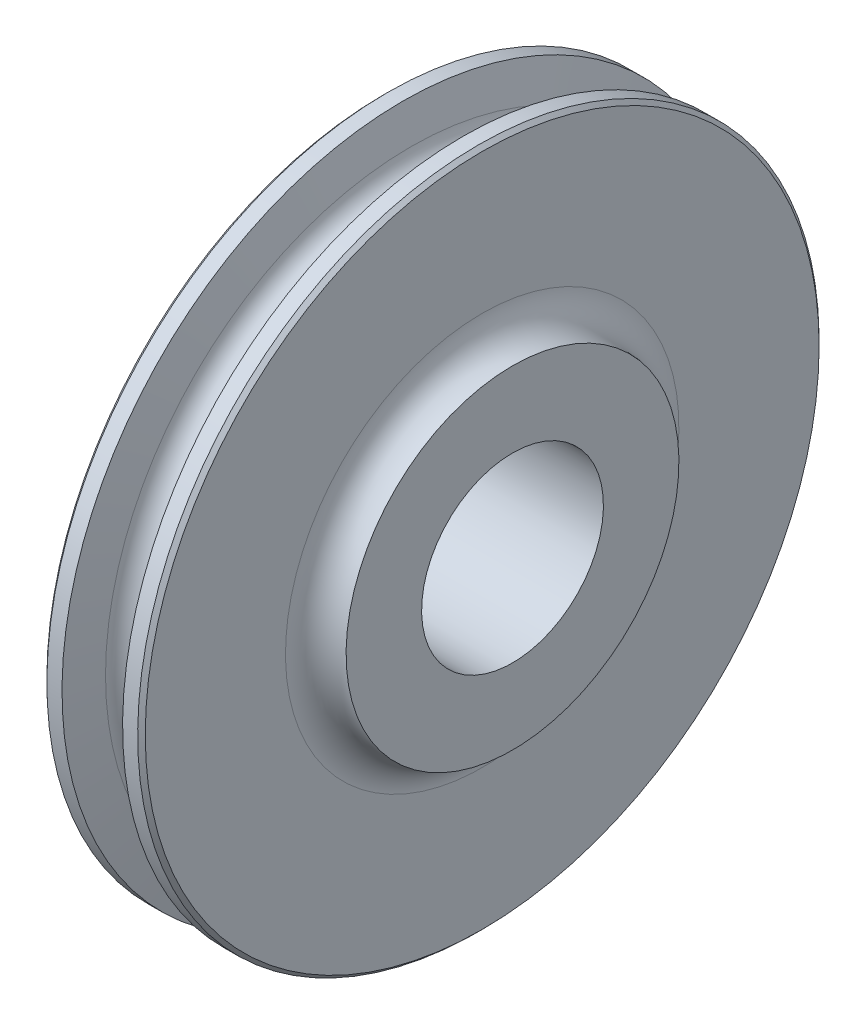
ISO-10303-21;
HEADER;
FILE_DESCRIPTION(('STEP AP214'),'2;1');
FILE_NAME('part.step','',(''),(''),'','','');
FILE_SCHEMA(('AUTOMOTIVE_DESIGN { 1 0 10303 214 1 1 1 1 }'));
ENDSEC;
DATA;
#1=APPLICATION_CONTEXT('core data for automotive mechanical design processes');
#2=APPLICATION_PROTOCOL_DEFINITION('international standard','automotive_design',2000,#1);
#3=PRODUCT_CONTEXT('',#1,'mechanical');
#4=PRODUCT('Part','Part','',(#3));
#5=PRODUCT_RELATED_PRODUCT_CATEGORY('part','',(#4));
#6=PRODUCT_DEFINITION_FORMATION('','',#4);
#7=PRODUCT_DEFINITION_CONTEXT('part definition',#1,'design');
#8=PRODUCT_DEFINITION('design','',#6,#7);
#9=PRODUCT_DEFINITION_SHAPE('','',#8);
#10=(LENGTH_UNIT() NAMED_UNIT(*) SI_UNIT(.MILLI.,.METRE.));
#11=(NAMED_UNIT(*) PLANE_ANGLE_UNIT() SI_UNIT($,.RADIAN.));
#12=(NAMED_UNIT(*) SI_UNIT($,.STERADIAN.) SOLID_ANGLE_UNIT());
#13=UNCERTAINTY_MEASURE_WITH_UNIT(LENGTH_MEASURE(1.E-05),#10,'distance_accuracy_value','');
#14=(GEOMETRIC_REPRESENTATION_CONTEXT(3) GLOBAL_UNCERTAINTY_ASSIGNED_CONTEXT((#13)) GLOBAL_UNIT_ASSIGNED_CONTEXT((#10,
#11,#12)) REPRESENTATION_CONTEXT('',''));
#15=CARTESIAN_POINT('',(0.,0.,0.));
#16=DIRECTION('',(0.,0.,1.));
#17=DIRECTION('',(1.,0.,0.));
#18=AXIS2_PLACEMENT_3D('',#15,#16,#17);
#19=CARTESIAN_POINT('',(-16.6624000000002,0.,0.));
#20=DIRECTION('',(1.,0.,0.));
#21=DIRECTION('',(0.,1.,0.));
#22=AXIS2_PLACEMENT_3D('',#19,#20,#21);
#23=TOROIDAL_SURFACE('',#22,41.2419723022209,6.35);
#24=CARTESIAN_POINT('',(-16.6624000000002,0.,0.));
#25=DIRECTION('',(1.,0.,0.));
#26=DIRECTION('',(0.,1.,0.));
#27=AXIS2_PLACEMENT_3D('',#24,#25,#26);
#28=CIRCLE('',#27,34.8919723022209);
#29=CARTESIAN_POINT('',(-16.6624000000001,34.891972302221,0.));
#30=VERTEX_POINT('',#29);
#31=EDGE_CURVE('E449',#30,#30,#28,.T.);
#32=ORIENTED_EDGE('',*,*,#31,.T.);
#33=EDGE_LOOP('',(#32));
#34=FACE_BOUND('',#33,.T.);
#35=CARTESIAN_POINT('',(-10.3124000000002,0.,0.));
#36=DIRECTION('',(1.,0.,0.));
#37=DIRECTION('',(0.,1.,0.));
#38=AXIS2_PLACEMENT_3D('',#35,#36,#37);
#39=CIRCLE('',#38,41.241972302221);
#40=CARTESIAN_POINT('',(-10.3124,41.241972302221,0.));
#41=VERTEX_POINT('',#40);
#42=EDGE_CURVE('E10',#41,#41,#39,.T.);
#43=ORIENTED_EDGE('',*,*,#42,.F.);
#44=EDGE_LOOP('',(#43));
#45=FACE_BOUND('',#44,.T.);
#46=ADVANCED_FACE('F403',(#34,#45),#23,.F.);
#47=CARTESIAN_POINT('',(-10.3123999999999,70.6373999999999,0.));
#48=DIRECTION('',(-1.,0.,0.));
#49=DIRECTION('',(0.,-1.,0.));
#50=AXIS2_PLACEMENT_3D('',#47,#48,#49);
#51=PLANE('',#50);
#52=ORIENTED_EDGE('',*,*,#42,.T.);
#53=EDGE_LOOP('',(#52));
#54=FACE_BOUND('',#53,.T.);
#55=CARTESIAN_POINT('',(-10.3124000000004,0.,0.));
#56=DIRECTION('',(1.,0.,0.));
#57=DIRECTION('',(0.,1.,0.));
#58=AXIS2_PLACEMENT_3D('',#55,#56,#57);
#59=CIRCLE('',#58,70.6373999999998);
#60=CARTESIAN_POINT('',(-10.3124,70.6373999999999,0.));
#61=VERTEX_POINT('',#60);
#62=EDGE_CURVE('E409',#61,#61,#59,.T.);
#63=ORIENTED_EDGE('',*,*,#62,.F.);
#64=EDGE_LOOP('',(#63));
#65=FACE_BOUND('',#64,.T.);
#66=ADVANCED_FACE('F481',(#54,#65),#51,.T.);
#67=CARTESIAN_POINT('',(-9.51865000000036,0.,0.));
#68=DIRECTION('',(1.,0.,0.));
#69=DIRECTION('',(0.,1.,0.));
#70=AXIS2_PLACEMENT_3D('',#67,#68,#69);
#71=CONICAL_SURFACE('',#70,71.4311499999998,0.785398163397448);
#72=ORIENTED_EDGE('',*,*,#62,.T.);
#73=EDGE_LOOP('',(#72));
#74=FACE_BOUND('',#73,.T.);
#75=CARTESIAN_POINT('',(-9.51865000000036,0.,0.));
#76=DIRECTION('',(1.,0.,0.));
#77=DIRECTION('',(0.,1.,0.));
#78=AXIS2_PLACEMENT_3D('',#75,#76,#77);
#79=CIRCLE('',#78,71.4311499999998);
#80=CARTESIAN_POINT('',(-9.51864999999997,71.4311499999999,0.));
#81=VERTEX_POINT('',#80);
#82=EDGE_CURVE('E413',#81,#81,#79,.T.);
#83=ORIENTED_EDGE('',*,*,#82,.F.);
#84=EDGE_LOOP('',(#83));
#85=FACE_BOUND('',#84,.T.);
#86=ADVANCED_FACE('F486',(#74,#85),#71,.T.);
#87=CARTESIAN_POINT('',(16.66875,0.,0.));
#88=DIRECTION('',(1.,0.,0.));
#89=DIRECTION('',(0.,1.,0.));
#90=AXIS2_PLACEMENT_3D('',#87,#88,#89);
#91=CYLINDRICAL_SURFACE('',#90,71.4311499999998);
#92=ORIENTED_EDGE('',*,*,#82,.T.);
#93=EDGE_LOOP('',(#92));
#94=FACE_BOUND('',#93,.T.);
#95=CARTESIAN_POINT('',(-6.35000000000039,0.,0.));
#96=DIRECTION('',(1.,0.,0.));
#97=DIRECTION('',(0.,1.,0.));
#98=AXIS2_PLACEMENT_3D('',#95,#96,#97);
#99=CIRCLE('',#98,71.4311499999999);
#100=CARTESIAN_POINT('',(-6.35,71.4311499999999,0.));
#101=VERTEX_POINT('',#100);
#102=EDGE_CURVE('E417',#101,#101,#99,.T.);
#103=ORIENTED_EDGE('',*,*,#102,.F.);
#104=EDGE_LOOP('',(#103));
#105=FACE_BOUND('',#104,.T.);
#106=ADVANCED_FACE('F569',(#94,#105),#91,.T.);
#107=CARTESIAN_POINT('',(-4.64075555889628,0.,0.));
#108=DIRECTION('',(-1.,0.,0.));
#109=DIRECTION('',(0.,-1.,0.));
#110=AXIS2_PLACEMENT_3D('',#107,#108,#109);
#111=CONICAL_SURFACE('',#110,64.0175494905947,1.34420065973754);
#112=ORIENTED_EDGE('',*,*,#102,.T.);
#113=EDGE_LOOP('',(#112));
#114=FACE_BOUND('',#113,.T.);
#115=CARTESIAN_POINT('',(-4.64075555889628,0.,0.));
#116=DIRECTION('',(1.,0.,0.));
#117=DIRECTION('',(0.,1.,0.));
#118=AXIS2_PLACEMENT_3D('',#115,#116,#117);
#119=CIRCLE('',#118,64.0175494905947);
#120=CARTESIAN_POINT('',(-4.64075555889593,64.0175494905947,0.));
#121=VERTEX_POINT('',#120);
#122=EDGE_CURVE('E422',#121,#121,#119,.T.);
#123=ORIENTED_EDGE('',*,*,#122,.F.);
#124=EDGE_LOOP('',(#123));
#125=FACE_BOUND('',#124,.T.);
#126=ADVANCED_FACE('F561',(#114,#125),#111,.T.);
#127=CARTESIAN_POINT('',(-3.53883589099269E-13,0.,0.));
#128=DIRECTION('',(1.,0.,0.));
#129=DIRECTION('',(0.,1.,0.));
#130=AXIS2_PLACEMENT_3D('',#127,#128,#129);
#131=TOROIDAL_SURFACE('',#130,65.0874999999999,4.7625);
#132=ORIENTED_EDGE('',*,*,#122,.T.);
#133=EDGE_LOOP('',(#132));
#134=FACE_BOUND('',#133,.T.);
#135=CARTESIAN_POINT('',(4.6407555588956,0.,0.));
#136=DIRECTION('',(1.,0.,0.));
#137=DIRECTION('',(0.,1.,0.));
#138=AXIS2_PLACEMENT_3D('',#135,#136,#137);
#139=CIRCLE('',#138,64.0175494905948);
#140=CARTESIAN_POINT('',(4.64075555889594,64.0175494905947,0.));
#141=VERTEX_POINT('',#140);
#142=EDGE_CURVE('E425',#141,#141,#139,.T.);
#143=ORIENTED_EDGE('',*,*,#142,.F.);
#144=EDGE_LOOP('',(#143));
#145=FACE_BOUND('',#144,.T.);
#146=ADVANCED_FACE('F553',(#134,#145),#131,.F.);
#147=CARTESIAN_POINT('',(6.34999999999962,0.,0.));
#148=DIRECTION('',(1.,0.,0.));
#149=DIRECTION('',(0.,1.,0.));
#150=AXIS2_PLACEMENT_3D('',#147,#148,#149);
#151=CONICAL_SURFACE('',#150,71.4311499999999,1.34420065973755);
#152=ORIENTED_EDGE('',*,*,#142,.T.);
#153=EDGE_LOOP('',(#152));
#154=FACE_BOUND('',#153,.T.);
#155=CARTESIAN_POINT('',(6.34999999999962,0.,0.));
#156=DIRECTION('',(1.,0.,0.));
#157=DIRECTION('',(0.,1.,0.));
#158=AXIS2_PLACEMENT_3D('',#155,#156,#157);
#159=CIRCLE('',#158,71.4311499999999);
#160=CARTESIAN_POINT('',(6.35,71.4311499999999,0.));
#161=VERTEX_POINT('',#160);
#162=EDGE_CURVE('E428',#161,#161,#159,.T.);
#163=ORIENTED_EDGE('',*,*,#162,.F.);
#164=EDGE_LOOP('',(#163));
#165=FACE_BOUND('',#164,.T.);
#166=ADVANCED_FACE('F545',(#154,#165),#151,.T.);
#167=CARTESIAN_POINT('',(16.66875,0.,0.));
#168=DIRECTION('',(1.,0.,0.));
#169=DIRECTION('',(0.,1.,0.));
#170=AXIS2_PLACEMENT_3D('',#167,#168,#169);
#171=CYLINDRICAL_SURFACE('',#170,71.4311499999999);
#172=ORIENTED_EDGE('',*,*,#162,.T.);
#173=EDGE_LOOP('',(#172));
#174=FACE_BOUND('',#173,.T.);
#175=CARTESIAN_POINT('',(9.51864999999959,0.,0.));
#176=DIRECTION('',(1.,0.,0.));
#177=DIRECTION('',(0.,1.,0.));
#178=AXIS2_PLACEMENT_3D('',#175,#176,#177);
#179=CIRCLE('',#178,71.4311499999999);
#180=CARTESIAN_POINT('',(9.51864999999997,71.4311499999999,0.));
#181=VERTEX_POINT('',#180);
#182=EDGE_CURVE('E431',#181,#181,#179,.T.);
#183=ORIENTED_EDGE('',*,*,#182,.F.);
#184=EDGE_LOOP('',(#183));
#185=FACE_BOUND('',#184,.T.);
#186=ADVANCED_FACE('F537',(#174,#185),#171,.T.);
#187=CARTESIAN_POINT('',(10.3123999999996,0.,0.));
#188=DIRECTION('',(-1.,0.,0.));
#189=DIRECTION('',(0.,-1.,0.));
#190=AXIS2_PLACEMENT_3D('',#187,#188,#189);
#191=CONICAL_SURFACE('',#190,70.6373999999999,0.785398163397444);
#192=ORIENTED_EDGE('',*,*,#182,.T.);
#193=EDGE_LOOP('',(#192));
#194=FACE_BOUND('',#193,.T.);
#195=CARTESIAN_POINT('',(10.3123999999996,0.,0.));
#196=DIRECTION('',(1.,0.,0.));
#197=DIRECTION('',(0.,1.,0.));
#198=AXIS2_PLACEMENT_3D('',#195,#196,#197);
#199=CIRCLE('',#198,70.6374);
#200=CARTESIAN_POINT('',(10.3124,70.6373999999999,0.));
#201=VERTEX_POINT('',#200);
#202=EDGE_CURVE('E434',#201,#201,#199,.T.);
#203=ORIENTED_EDGE('',*,*,#202,.F.);
#204=EDGE_LOOP('',(#203));
#205=FACE_BOUND('',#204,.T.);
#206=ADVANCED_FACE('F529',(#194,#205),#191,.T.);
#207=CARTESIAN_POINT('',(10.3124000000001,70.6373999999999,0.));
#208=DIRECTION('',(1.,0.,0.));
#209=DIRECTION('',(0.,1.,0.));
#210=AXIS2_PLACEMENT_3D('',#207,#208,#209);
#211=PLANE('',#210);
#212=ORIENTED_EDGE('',*,*,#202,.T.);
#213=EDGE_LOOP('',(#212));
#214=FACE_BOUND('',#213,.T.);
#215=CARTESIAN_POINT('',(10.3123999999997,0.,0.));
#216=DIRECTION('',(1.,0.,0.));
#217=DIRECTION('',(0.,1.,0.));
#218=AXIS2_PLACEMENT_3D('',#215,#216,#217);
#219=CIRCLE('',#218,41.2419723022211);
#220=CARTESIAN_POINT('',(10.3124,41.241972302221,0.));
#221=VERTEX_POINT('',#220);
#222=EDGE_CURVE('E437',#221,#221,#219,.T.);
#223=ORIENTED_EDGE('',*,*,#222,.F.);
#224=EDGE_LOOP('',(#223));
#225=FACE_BOUND('',#224,.T.);
#226=ADVANCED_FACE('F477',(#214,#225),#211,.T.);
#227=CARTESIAN_POINT('',(16.6623999999997,0.,0.));
#228=DIRECTION('',(1.,0.,0.));
#229=DIRECTION('',(0.,1.,0.));
#230=AXIS2_PLACEMENT_3D('',#227,#228,#229);
#231=TOROIDAL_SURFACE('',#230,41.2419723022211,6.35);
#232=ORIENTED_EDGE('',*,*,#222,.T.);
#233=EDGE_LOOP('',(#232));
#234=FACE_BOUND('',#233,.T.);
#235=CARTESIAN_POINT('',(16.6623999999998,0.,0.));
#236=DIRECTION('',(1.,0.,0.));
#237=DIRECTION('',(0.,1.,0.));
#238=AXIS2_PLACEMENT_3D('',#235,#236,#237);
#239=CIRCLE('',#238,34.8919723022211);
#240=CARTESIAN_POINT('',(16.6624,34.891972302221,0.));
#241=VERTEX_POINT('',#240);
#242=EDGE_CURVE('E440',#241,#241,#239,.T.);
#243=ORIENTED_EDGE('',*,*,#242,.F.);
#244=EDGE_LOOP('',(#243));
#245=FACE_BOUND('',#244,.T.);
#246=ADVANCED_FACE('F470',(#234,#245),#231,.F.);
#247=CARTESIAN_POINT('',(16.66875,0.,0.));
#248=DIRECTION('',(1.,0.,0.));
#249=DIRECTION('',(0.,1.,0.));
#250=AXIS2_PLACEMENT_3D('',#247,#248,#249);
#251=CYLINDRICAL_SURFACE('',#250,34.8919723022211);
#252=ORIENTED_EDGE('',*,*,#242,.T.);
#253=EDGE_LOOP('',(#252));
#254=FACE_BOUND('',#253,.T.);
#255=CARTESIAN_POINT('',(16.6687499999996,0.,0.));
#256=DIRECTION('',(1.,0.,0.));
#257=DIRECTION('',(0.,1.,0.));
#258=AXIS2_PLACEMENT_3D('',#255,#256,#257);
#259=CIRCLE('',#258,34.8919723022211);
#260=CARTESIAN_POINT('',(16.6687499999998,34.891972302221,0.));
#261=VERTEX_POINT('',#260);
#262=EDGE_CURVE('E443',#261,#261,#259,.T.);
#263=ORIENTED_EDGE('',*,*,#262,.F.);
#264=EDGE_LOOP('',(#263));
#265=FACE_BOUND('',#264,.T.);
#266=ADVANCED_FACE('F465',(#254,#265),#251,.T.);
#267=CARTESIAN_POINT('',(16.66875,34.891972302221,0.));
#268=DIRECTION('',(1.,0.,0.));
#269=DIRECTION('',(0.,1.,0.));
#270=AXIS2_PLACEMENT_3D('',#267,#268,#269);
#271=PLANE('',#270);
#272=CARTESIAN_POINT('',(16.6687499999998,0.,0.));
#273=DIRECTION('',(1.,0.,0.));
#274=DIRECTION('',(0.,1.,0.));
#275=AXIS2_PLACEMENT_3D('',#272,#273,#274);
#276=CIRCLE('',#275,19.0627);
#277=CARTESIAN_POINT('',(16.6687499999999,19.0626999999999,0.));
#278=VERTEX_POINT('',#277);
#279=EDGE_CURVE('E455',#278,#278,#276,.T.);
#280=ORIENTED_EDGE('',*,*,#279,.F.);
#281=EDGE_LOOP('',(#280));
#282=FACE_BOUND('',#281,.T.);
#283=ORIENTED_EDGE('',*,*,#262,.T.);
#284=EDGE_LOOP('',(#283));
#285=FACE_BOUND('',#284,.T.);
#286=ADVANCED_FACE('F461',(#282,#285),#271,.T.);
#287=CARTESIAN_POINT('',(-16.6687499999999,34.891972302221,0.));
#288=DIRECTION('',(-1.,0.,0.));
#289=DIRECTION('',(0.,-1.,0.));
#290=AXIS2_PLACEMENT_3D('',#287,#288,#289);
#291=PLANE('',#290);
#292=CARTESIAN_POINT('',(-16.6687500000004,0.,0.));
#293=DIRECTION('',(1.,0.,0.));
#294=DIRECTION('',(0.,1.,0.));
#295=AXIS2_PLACEMENT_3D('',#292,#293,#294);
#296=CIRCLE('',#295,19.0627);
#297=CARTESIAN_POINT('',(-16.6687500000003,19.0627000000001,0.));
#298=VERTEX_POINT('',#297);
#299=EDGE_CURVE('E452',#298,#298,#296,.T.);
#300=ORIENTED_EDGE('',*,*,#299,.T.);
#301=EDGE_LOOP('',(#300));
#302=FACE_BOUND('',#301,.T.);
#303=CARTESIAN_POINT('',(-16.6687500000002,0.,0.));
#304=DIRECTION('',(1.,0.,0.));
#305=DIRECTION('',(0.,1.,0.));
#306=AXIS2_PLACEMENT_3D('',#303,#304,#305);
#307=CIRCLE('',#306,34.8919723022209);
#308=CARTESIAN_POINT('',(-16.66875,34.891972302221,0.));
#309=VERTEX_POINT('',#308);
#310=EDGE_CURVE('E446',#309,#309,#307,.T.);
#311=ORIENTED_EDGE('',*,*,#310,.F.);
#312=EDGE_LOOP('',(#311));
#313=FACE_BOUND('',#312,.T.);
#314=ADVANCED_FACE('F464',(#302,#313),#291,.T.);
#315=CARTESIAN_POINT('',(16.66875,0.,0.));
#316=DIRECTION('',(1.,0.,0.));
#317=DIRECTION('',(0.,1.,0.));
#318=AXIS2_PLACEMENT_3D('',#315,#316,#317);
#319=CYLINDRICAL_SURFACE('',#318,34.8919723022209);
#320=ORIENTED_EDGE('',*,*,#310,.T.);
#321=EDGE_LOOP('',(#320));
#322=FACE_BOUND('',#321,.T.);
#323=ORIENTED_EDGE('',*,*,#31,.F.);
#324=EDGE_LOOP('',(#323));
#325=FACE_BOUND('',#324,.T.);
#326=ADVANCED_FACE('F490',(#322,#325),#319,.T.);
#327=CARTESIAN_POINT('',(-16.6687500000004,0.,0.));
#328=DIRECTION('',(1.,0.,0.));
#329=DIRECTION('',(0.,1.,0.));
#330=AXIS2_PLACEMENT_3D('',#327,#328,#329);
#331=CYLINDRICAL_SURFACE('',#330,19.0627);
#332=ORIENTED_EDGE('',*,*,#299,.F.);
#333=EDGE_LOOP('',(#332));
#334=FACE_BOUND('',#333,.T.);
#335=ORIENTED_EDGE('',*,*,#279,.T.);
#336=EDGE_LOOP('',(#335));
#337=FACE_BOUND('',#336,.T.);
#338=ADVANCED_FACE('F459',(#334,#337),#331,.F.);
#339=CLOSED_SHELL('',(#46,#66,#86,#106,#126,#146,#166,#186,#206,#226,#246,#266,#286,#314,#326,#338));
#340=MANIFOLD_SOLID_BREP('B2',#339);
#341=ADVANCED_BREP_SHAPE_REPRESENTATION('',(#18,#340),#14);
#342=SHAPE_DEFINITION_REPRESENTATION(#9,#341);
ENDSEC;
END-ISO-10303-21;
